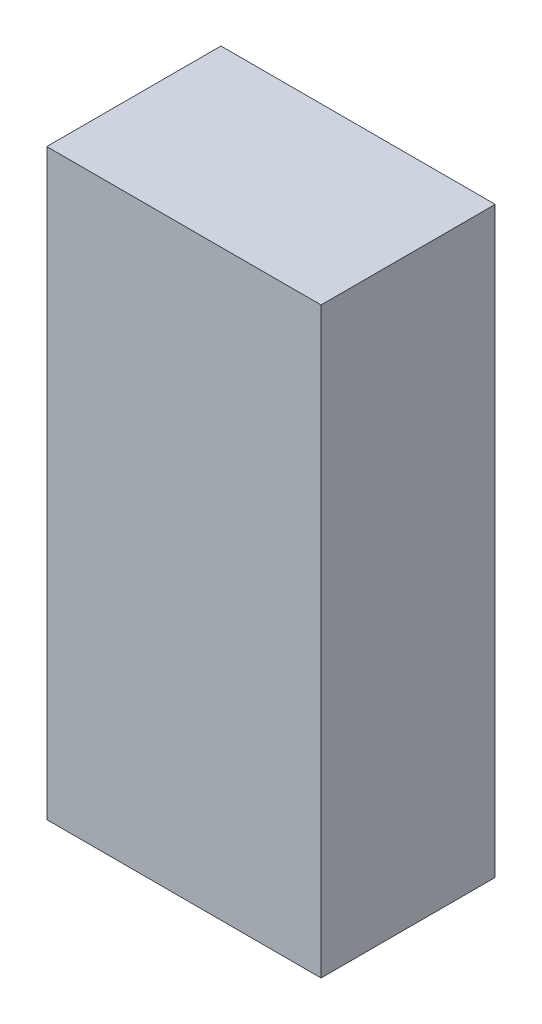
ISO-10303-21;
HEADER;
FILE_DESCRIPTION(('STEP AP214'),'2;1');
FILE_NAME('part.step','',(''),(''),'','','');
FILE_SCHEMA(('AUTOMOTIVE_DESIGN { 1 0 10303 214 1 1 1 1 }'));
ENDSEC;
DATA;
#1=APPLICATION_CONTEXT('core data for automotive mechanical design processes');
#2=APPLICATION_PROTOCOL_DEFINITION('international standard','automotive_design',2000,#1);
#3=PRODUCT_CONTEXT('',#1,'mechanical');
#4=PRODUCT('Part','Part','',(#3));
#5=PRODUCT_RELATED_PRODUCT_CATEGORY('part','',(#4));
#6=PRODUCT_DEFINITION_FORMATION('','',#4);
#7=PRODUCT_DEFINITION_CONTEXT('part definition',#1,'design');
#8=PRODUCT_DEFINITION('design','',#6,#7);
#9=PRODUCT_DEFINITION_SHAPE('','',#8);
#10=(LENGTH_UNIT() NAMED_UNIT(*) SI_UNIT(.MILLI.,.METRE.));
#11=(NAMED_UNIT(*) PLANE_ANGLE_UNIT() SI_UNIT($,.RADIAN.));
#12=(NAMED_UNIT(*) SI_UNIT($,.STERADIAN.) SOLID_ANGLE_UNIT());
#13=UNCERTAINTY_MEASURE_WITH_UNIT(LENGTH_MEASURE(1.E-05),#10,'distance_accuracy_value','');
#14=(GEOMETRIC_REPRESENTATION_CONTEXT(3) GLOBAL_UNCERTAINTY_ASSIGNED_CONTEXT((#13)) GLOBAL_UNIT_ASSIGNED_CONTEXT((#10,
#11,#12)) REPRESENTATION_CONTEXT('',''));
#15=CARTESIAN_POINT('',(0.,0.,0.));
#16=DIRECTION('',(0.,0.,1.));
#17=DIRECTION('',(1.,0.,0.));
#18=AXIS2_PLACEMENT_3D('',#15,#16,#17);
#19=CARTESIAN_POINT('',(-0.1999996,0.42500042,0.));
#20=DIRECTION('',(1.,0.,0.));
#21=DIRECTION('',(0.,-1.,0.));
#22=AXIS2_PLACEMENT_3D('',#19,#20,#21);
#23=PLANE('',#22);
#24=DIRECTION('',(0.,-1.,0.));
#25=VECTOR('',#24,1.);
#26=CARTESIAN_POINT('',(-0.1999996,0.42500042,0.));
#27=LINE('',#26,#25);
#28=CARTESIAN_POINT('',(-0.1999996,0.42500042,0.));
#29=VERTEX_POINT('',#28);
#30=CARTESIAN_POINT('',(-0.1999996,-0.42500042,0.));
#31=VERTEX_POINT('',#30);
#32=EDGE_CURVE('E11',#29,#31,#27,.T.);
#33=ORIENTED_EDGE('',*,*,#32,.T.);
#34=DIRECTION('',(0.,0.,1.));
#35=VECTOR('',#34,1.);
#36=CARTESIAN_POINT('',(-0.1999996,-0.42500042,0.));
#37=LINE('',#36,#35);
#38=CARTESIAN_POINT('',(-0.1999996,-0.42500042,0.254));
#39=VERTEX_POINT('',#38);
#40=EDGE_CURVE('E24',#31,#39,#37,.T.);
#41=ORIENTED_EDGE('',*,*,#40,.T.);
#42=DIRECTION('',(0.,-1.,0.));
#43=VECTOR('',#42,1.);
#44=CARTESIAN_POINT('',(-0.1999996,0.42500042,0.254));
#45=LINE('',#44,#43);
#46=CARTESIAN_POINT('',(-0.1999996,0.42500042,0.254));
#47=VERTEX_POINT('',#46);
#48=EDGE_CURVE('E87',#47,#39,#45,.T.);
#49=ORIENTED_EDGE('',*,*,#48,.F.);
#50=DIRECTION('',(0.,0.,1.));
#51=VECTOR('',#50,1.);
#52=CARTESIAN_POINT('',(-0.1999996,0.42500042,0.));
#53=LINE('',#52,#51);
#54=EDGE_CURVE('E36',#29,#47,#53,.T.);
#55=ORIENTED_EDGE('',*,*,#54,.F.);
#56=EDGE_LOOP('',(#33,#41,#49,#55));
#57=FACE_BOUND('',#56,.T.);
#58=ADVANCED_FACE('F17',(#57),#23,.F.);
#59=CARTESIAN_POINT('',(-0.1999996,-0.42500042,0.));
#60=DIRECTION('',(0.,1.,0.));
#61=DIRECTION('',(1.,0.,0.));
#62=AXIS2_PLACEMENT_3D('',#59,#60,#61);
#63=PLANE('',#62);
#64=DIRECTION('',(1.,0.,0.));
#65=VECTOR('',#64,1.);
#66=CARTESIAN_POINT('',(-0.1999996,-0.42500042,0.));
#67=LINE('',#66,#65);
#68=CARTESIAN_POINT('',(0.20000214,-0.42500042,0.));
#69=VERTEX_POINT('',#68);
#70=EDGE_CURVE('E84',#31,#69,#67,.T.);
#71=ORIENTED_EDGE('',*,*,#70,.T.);
#72=DIRECTION('',(0.,0.,1.));
#73=VECTOR('',#72,1.);
#74=CARTESIAN_POINT('',(0.20000214,-0.42500042,0.));
#75=LINE('',#74,#73);
#76=CARTESIAN_POINT('',(0.20000214,-0.42500042,0.254));
#77=VERTEX_POINT('',#76);
#78=EDGE_CURVE('E82',#69,#77,#75,.T.);
#79=ORIENTED_EDGE('',*,*,#78,.T.);
#80=DIRECTION('',(1.,0.,0.));
#81=VECTOR('',#80,1.);
#82=CARTESIAN_POINT('',(-0.1999996,-0.42500042,0.254));
#83=LINE('',#82,#81);
#84=EDGE_CURVE('E62',#39,#77,#83,.T.);
#85=ORIENTED_EDGE('',*,*,#84,.F.);
#86=ORIENTED_EDGE('',*,*,#40,.F.);
#87=EDGE_LOOP('',(#71,#79,#85,#86));
#88=FACE_BOUND('',#87,.T.);
#89=ADVANCED_FACE('F89',(#88),#63,.F.);
#90=CARTESIAN_POINT('',(0.20000214,-0.42500042,0.));
#91=DIRECTION('',(-1.,0.,0.));
#92=DIRECTION('',(0.,1.,0.));
#93=AXIS2_PLACEMENT_3D('',#90,#91,#92);
#94=PLANE('',#93);
#95=DIRECTION('',(0.,1.,0.));
#96=VECTOR('',#95,1.);
#97=CARTESIAN_POINT('',(0.20000214,-0.42500042,0.));
#98=LINE('',#97,#96);
#99=CARTESIAN_POINT('',(0.20000214,0.42500042,0.));
#100=VERTEX_POINT('',#99);
#101=EDGE_CURVE('E71',#69,#100,#98,.T.);
#102=ORIENTED_EDGE('',*,*,#101,.T.);
#103=DIRECTION('',(0.,0.,1.));
#104=VECTOR('',#103,1.);
#105=CARTESIAN_POINT('',(0.20000214,0.42500042,0.));
#106=LINE('',#105,#104);
#107=CARTESIAN_POINT('',(0.20000214,0.42500042,0.254));
#108=VERTEX_POINT('',#107);
#109=EDGE_CURVE('E65',#100,#108,#106,.T.);
#110=ORIENTED_EDGE('',*,*,#109,.T.);
#111=DIRECTION('',(0.,1.,0.));
#112=VECTOR('',#111,1.);
#113=CARTESIAN_POINT('',(0.20000214,-0.42500042,0.254));
#114=LINE('',#113,#112);
#115=EDGE_CURVE('E57',#77,#108,#114,.T.);
#116=ORIENTED_EDGE('',*,*,#115,.F.);
#117=ORIENTED_EDGE('',*,*,#78,.F.);
#118=EDGE_LOOP('',(#102,#110,#116,#117));
#119=FACE_BOUND('',#118,.T.);
#120=ADVANCED_FACE('F69',(#119),#94,.F.);
#121=CARTESIAN_POINT('',(0.20000214,0.42500042,0.));
#122=DIRECTION('',(0.,-1.,0.));
#123=DIRECTION('',(-1.,0.,0.));
#124=AXIS2_PLACEMENT_3D('',#121,#122,#123);
#125=PLANE('',#124);
#126=DIRECTION('',(-1.,0.,0.));
#127=VECTOR('',#126,1.);
#128=CARTESIAN_POINT('',(0.20000214,0.42500042,0.));
#129=LINE('',#128,#127);
#130=EDGE_CURVE('E66',#100,#29,#129,.T.);
#131=ORIENTED_EDGE('',*,*,#130,.T.);
#132=ORIENTED_EDGE('',*,*,#54,.T.);
#133=DIRECTION('',(-1.,0.,0.));
#134=VECTOR('',#133,1.);
#135=CARTESIAN_POINT('',(0.20000214,0.42500042,0.254));
#136=LINE('',#135,#134);
#137=EDGE_CURVE('E61',#108,#47,#136,.T.);
#138=ORIENTED_EDGE('',*,*,#137,.F.);
#139=ORIENTED_EDGE('',*,*,#109,.F.);
#140=EDGE_LOOP('',(#131,#132,#138,#139));
#141=FACE_BOUND('',#140,.T.);
#142=ADVANCED_FACE('F76',(#141),#125,.F.);
#143=CARTESIAN_POINT('',(-0.1999996,0.42500042,0.));
#144=DIRECTION('',(0.,0.,-1.));
#145=DIRECTION('',(-1.,0.,0.));
#146=AXIS2_PLACEMENT_3D('',#143,#144,#145);
#147=PLANE('',#146);
#148=ORIENTED_EDGE('',*,*,#130,.F.);
#149=ORIENTED_EDGE('',*,*,#101,.F.);
#150=ORIENTED_EDGE('',*,*,#70,.F.);
#151=ORIENTED_EDGE('',*,*,#32,.F.);
#152=EDGE_LOOP('',(#148,#149,#150,#151));
#153=FACE_BOUND('',#152,.T.);
#154=ADVANCED_FACE('F91',(#153),#147,.T.);
#155=CARTESIAN_POINT('',(-0.1999996,0.42500042,0.254));
#156=DIRECTION('',(0.,0.,-1.));
#157=DIRECTION('',(-1.,0.,0.));
#158=AXIS2_PLACEMENT_3D('',#155,#156,#157);
#159=PLANE('',#158);
#160=ORIENTED_EDGE('',*,*,#48,.T.);
#161=ORIENTED_EDGE('',*,*,#84,.T.);
#162=ORIENTED_EDGE('',*,*,#115,.T.);
#163=ORIENTED_EDGE('',*,*,#137,.T.);
#164=EDGE_LOOP('',(#160,#161,#162,#163));
#165=FACE_BOUND('',#164,.T.);
#166=ADVANCED_FACE('F59',(#165),#159,.F.);
#167=CLOSED_SHELL('',(#58,#89,#120,#142,#154,#166));
#168=MANIFOLD_SOLID_BREP('B1',#167);
#169=ADVANCED_BREP_SHAPE_REPRESENTATION('',(#18,#168),#14);
#170=SHAPE_DEFINITION_REPRESENTATION(#9,#169);
ENDSEC;
END-ISO-10303-21;
